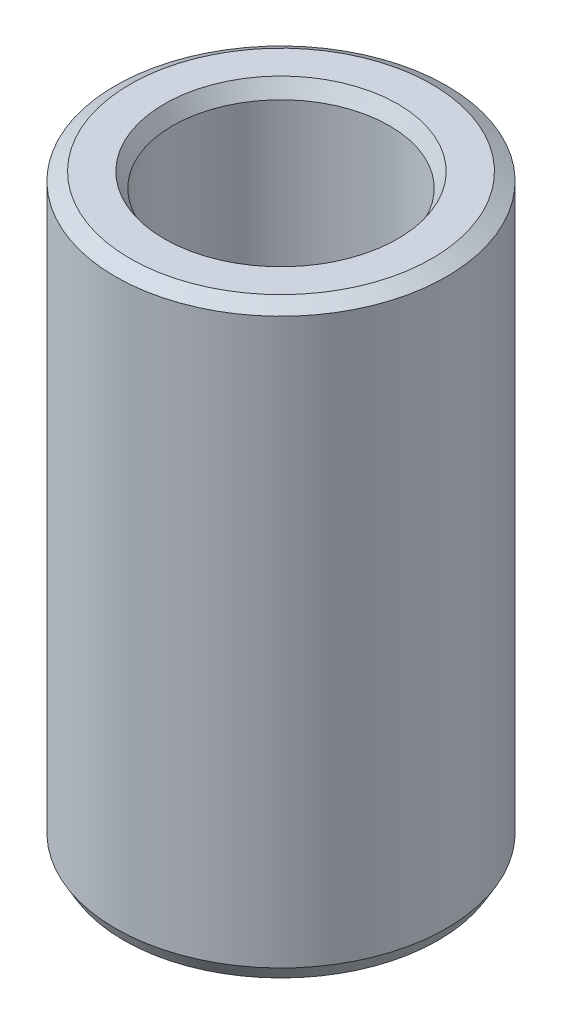
ISO-10303-21;
HEADER;
FILE_DESCRIPTION(('STEP AP214'),'2;1');
FILE_NAME('part.step','',(''),(''),'','','');
FILE_SCHEMA(('AUTOMOTIVE_DESIGN { 1 0 10303 214 1 1 1 1 }'));
ENDSEC;
DATA;
#1=APPLICATION_CONTEXT('core data for automotive mechanical design processes');
#2=APPLICATION_PROTOCOL_DEFINITION('international standard','automotive_design',2000,#1);
#3=PRODUCT_CONTEXT('',#1,'mechanical');
#4=PRODUCT('Part','Part','',(#3));
#5=PRODUCT_RELATED_PRODUCT_CATEGORY('part','',(#4));
#6=PRODUCT_DEFINITION_FORMATION('','',#4);
#7=PRODUCT_DEFINITION_CONTEXT('part definition',#1,'design');
#8=PRODUCT_DEFINITION('design','',#6,#7);
#9=PRODUCT_DEFINITION_SHAPE('','',#8);
#10=(LENGTH_UNIT() NAMED_UNIT(*) SI_UNIT(.MILLI.,.METRE.));
#11=(NAMED_UNIT(*) PLANE_ANGLE_UNIT() SI_UNIT($,.RADIAN.));
#12=(NAMED_UNIT(*) SI_UNIT($,.STERADIAN.) SOLID_ANGLE_UNIT());
#13=UNCERTAINTY_MEASURE_WITH_UNIT(LENGTH_MEASURE(1.E-05),#10,'distance_accuracy_value','');
#14=(GEOMETRIC_REPRESENTATION_CONTEXT(3) GLOBAL_UNCERTAINTY_ASSIGNED_CONTEXT((#13)) GLOBAL_UNIT_ASSIGNED_CONTEXT((#10,
#11,#12)) REPRESENTATION_CONTEXT('',''));
#15=CARTESIAN_POINT('',(0.,0.,0.));
#16=DIRECTION('',(0.,0.,1.));
#17=DIRECTION('',(1.,0.,0.));
#18=AXIS2_PLACEMENT_3D('',#15,#16,#17);
#19=CARTESIAN_POINT('',(0.,141.943823189804,0.));
#20=DIRECTION('',(0.,-1.,0.));
#21=DIRECTION('',(0.,0.,-1.));
#22=AXIS2_PLACEMENT_3D('',#19,#20,#21);
#23=CYLINDRICAL_SURFACE('',#22,40.);
#24=CARTESIAN_POINT('',(0.,3.52593530413128,0.));
#25=DIRECTION('',(0.,1.,0.));
#26=DIRECTION('',(0.,0.,1.));
#27=AXIS2_PLACEMENT_3D('',#24,#25,#26);
#28=CIRCLE('',#27,40.);
#29=CARTESIAN_POINT('',(0.,3.52593530413128,40.));
#30=VERTEX_POINT('',#29);
#31=EDGE_CURVE('E10',#30,#30,#28,.T.);
#32=ORIENTED_EDGE('',*,*,#31,.T.);
#33=EDGE_LOOP('',(#32));
#34=FACE_BOUND('',#33,.T.);
#35=CARTESIAN_POINT('',(0.,139.908123492819,0.));
#36=DIRECTION('',(0.,1.,0.));
#37=DIRECTION('',(0.,0.,1.));
#38=AXIS2_PLACEMENT_3D('',#35,#36,#37);
#39=CIRCLE('',#38,40.);
#40=CARTESIAN_POINT('',(0.,139.908123492819,40.));
#41=VERTEX_POINT('',#40);
#42=EDGE_CURVE('E50',#41,#41,#39,.F.);
#43=ORIENTED_EDGE('',*,*,#42,.T.);
#44=EDGE_LOOP('',(#43));
#45=FACE_BOUND('',#44,.T.);
#46=ADVANCED_FACE('F39',(#34,#45),#23,.T.);
#47=CARTESIAN_POINT('',(0.,141.943823189804,0.));
#48=DIRECTION('',(0.,1.,0.));
#49=DIRECTION('',(0.,0.,1.));
#50=AXIS2_PLACEMENT_3D('',#47,#48,#49);
#51=PLANE('',#50);
#52=CARTESIAN_POINT('',(0.,141.943823189804,0.));
#53=DIRECTION('',(0.,1.,0.));
#54=DIRECTION('',(0.,0.,1.));
#55=AXIS2_PLACEMENT_3D('',#52,#53,#54);
#56=CIRCLE('',#55,28.2261651632006);
#57=CARTESIAN_POINT('',(0.,141.943823189804,28.2261651632006));
#58=VERTEX_POINT('',#57);
#59=EDGE_CURVE('E58',#58,#58,#56,.F.);
#60=ORIENTED_EDGE('',*,*,#59,.T.);
#61=EDGE_LOOP('',(#60));
#62=FACE_BOUND('',#61,.T.);
#63=CARTESIAN_POINT('',(0.,141.943823189804,0.));
#64=DIRECTION('',(0.,1.,0.));
#65=DIRECTION('',(0.,0.,1.));
#66=AXIS2_PLACEMENT_3D('',#63,#64,#65);
#67=CIRCLE('',#66,36.4740646958687);
#68=CARTESIAN_POINT('',(0.,141.943823189804,36.4740646958687));
#69=VERTEX_POINT('',#68);
#70=EDGE_CURVE('E61',#69,#69,#67,.T.);
#71=ORIENTED_EDGE('',*,*,#70,.T.);
#72=EDGE_LOOP('',(#71));
#73=FACE_BOUND('',#72,.T.);
#74=ADVANCED_FACE('F88',(#62,#73),#51,.T.);
#75=CARTESIAN_POINT('',(0.,0.,0.));
#76=DIRECTION('',(0.,1.,0.));
#77=DIRECTION('',(0.,0.,1.));
#78=AXIS2_PLACEMENT_3D('',#75,#76,#77);
#79=PLANE('',#78);
#80=CARTESIAN_POINT('',(0.,0.,0.));
#81=DIRECTION('',(0.,1.,0.));
#82=DIRECTION('',(0.,0.,1.));
#83=AXIS2_PLACEMENT_3D('',#80,#81,#82);
#84=CIRCLE('',#83,29.7164007703465);
#85=CARTESIAN_POINT('',(0.,0.,29.7164007703465));
#86=VERTEX_POINT('',#85);
#87=EDGE_CURVE('E51',#86,#86,#84,.T.);
#88=ORIENTED_EDGE('',*,*,#87,.T.);
#89=EDGE_LOOP('',(#88));
#90=FACE_BOUND('',#89,.T.);
#91=CARTESIAN_POINT('',(0.,0.,0.));
#92=DIRECTION('',(0.,1.,0.));
#93=DIRECTION('',(0.,0.,1.));
#94=AXIS2_PLACEMENT_3D('',#91,#92,#93);
#95=CIRCLE('',#94,37.9643003030146);
#96=CARTESIAN_POINT('',(0.,0.,37.9643003030146));
#97=VERTEX_POINT('',#96);
#98=EDGE_CURVE('E54',#97,#97,#95,.F.);
#99=ORIENTED_EDGE('',*,*,#98,.T.);
#100=EDGE_LOOP('',(#99));
#101=FACE_BOUND('',#100,.T.);
#102=ADVANCED_FACE('F83',(#90,#101),#79,.F.);
#103=CARTESIAN_POINT('',(0.,141.943823189804,0.));
#104=DIRECTION('',(0.,-1.,0.));
#105=DIRECTION('',(0.,0.,-1.));
#106=AXIS2_PLACEMENT_3D('',#103,#104,#105);
#107=CYLINDRICAL_SURFACE('',#106,26.1904654662152);
#108=CARTESIAN_POINT('',(0.,138.417887885673,0.));
#109=DIRECTION('',(0.,1.,0.));
#110=DIRECTION('',(0.,0.,1.));
#111=AXIS2_PLACEMENT_3D('',#108,#109,#110);
#112=CIRCLE('',#111,26.1904654662152);
#113=CARTESIAN_POINT('',(0.,138.417887885673,26.1904654662152));
#114=VERTEX_POINT('',#113);
#115=EDGE_CURVE('E67',#114,#114,#112,.T.);
#116=ORIENTED_EDGE('',*,*,#115,.T.);
#117=EDGE_LOOP('',(#116));
#118=FACE_BOUND('',#117,.T.);
#119=CARTESIAN_POINT('',(0.,2.03569969698544,0.));
#120=DIRECTION('',(0.,1.,0.));
#121=DIRECTION('',(0.,0.,1.));
#122=AXIS2_PLACEMENT_3D('',#119,#120,#121);
#123=CIRCLE('',#122,26.1904654662152);
#124=CARTESIAN_POINT('',(0.,2.03569969698544,26.1904654662152));
#125=VERTEX_POINT('',#124);
#126=EDGE_CURVE('E69',#125,#125,#123,.F.);
#127=ORIENTED_EDGE('',*,*,#126,.T.);
#128=EDGE_LOOP('',(#127));
#129=FACE_BOUND('',#128,.T.);
#130=ADVANCED_FACE('F71',(#118,#129),#107,.F.);
#131=CARTESIAN_POINT('',(0.,138.417887885673,0.));
#132=DIRECTION('',(0.,1.,0.));
#133=DIRECTION('',(0.,0.,1.));
#134=AXIS2_PLACEMENT_3D('',#131,#132,#133);
#135=CONICAL_SURFACE('',#134,26.1904654662152,0.5235987755983);
#136=CARTESIAN_POINT('',(0.,141.943823189804,28.2261651632006));
#137=CARTESIAN_POINT('',(0.,141.907094697053,28.2049599580237));
#138=CARTESIAN_POINT('',(0.,141.870366204301,28.1837547528468));
#139=CARTESIAN_POINT('',(0.,141.796909218799,28.1413443424929));
#140=CARTESIAN_POINT('',(0.,141.760180726047,28.120139137316));
#141=CARTESIAN_POINT('',(0.,141.686723740544,28.0777287269621));
#142=CARTESIAN_POINT('',(0.,141.649995247793,28.0565235217852));
#143=CARTESIAN_POINT('',(0.,141.57653826229,28.0141131114313));
#144=CARTESIAN_POINT('',(0.,141.539809769539,27.9929079062544));
#145=CARTESIAN_POINT('',(0.,141.466352784036,27.9504974959005));
#146=CARTESIAN_POINT('',(0.,141.429624291285,27.9292922907236));
#147=CARTESIAN_POINT('',(0.,141.356167305782,27.8868818803697));
#148=CARTESIAN_POINT('',(0.,141.319438813031,27.8656766751928));
#149=CARTESIAN_POINT('',(0.,141.245981827528,27.8232662648389));
#150=CARTESIAN_POINT('',(0.,141.209253334777,27.802061059662));
#151=CARTESIAN_POINT('',(0.,141.135796349274,27.7596506493081));
#152=CARTESIAN_POINT('',(0.,141.099067856523,27.7384454441312));
#153=CARTESIAN_POINT('',(0.,141.02561087102,27.6960350337773));
#154=CARTESIAN_POINT('',(0.,140.988882378268,27.6748298286004));
#155=CARTESIAN_POINT('',(0.,140.915425392766,27.6324194182465));
#156=CARTESIAN_POINT('',(0.,140.878696900014,27.6112142130696));
#157=CARTESIAN_POINT('',(0.,140.805239914512,27.5688038027157));
#158=CARTESIAN_POINT('',(0.,140.76851142176,27.5475985975388));
#159=CARTESIAN_POINT('',(0.,140.695054436258,27.5051881871849));
#160=CARTESIAN_POINT('',(0.,140.658325943506,27.483982982008));
#161=CARTESIAN_POINT('',(0.,140.584868958003,27.4415725716542));
#162=CARTESIAN_POINT('',(0.,140.548140465252,27.4203673664772));
#163=CARTESIAN_POINT('',(0.,140.474683479749,27.3779569561234));
#164=CARTESIAN_POINT('',(0.,140.437954986998,27.3567517509464));
#165=CARTESIAN_POINT('',(0.,140.364498001495,27.3143413405926));
#166=CARTESIAN_POINT('',(0.,140.327769508744,27.2931361354156));
#167=CARTESIAN_POINT('',(0.,140.254312523241,27.2507257250618));
#168=CARTESIAN_POINT('',(0.,140.21758403049,27.2295205198848));
#169=CARTESIAN_POINT('',(0.,140.144127044987,27.187110109531));
#170=CARTESIAN_POINT('',(0.,140.107398552236,27.165904904354));
#171=CARTESIAN_POINT('',(0.,140.033941566733,27.1234944940002));
#172=CARTESIAN_POINT('',(0.,139.997213073982,27.1022892888232));
#173=CARTESIAN_POINT('',(0.,139.923756088479,27.0598788784694));
#174=CARTESIAN_POINT('',(0.,139.887027595727,27.0386736732925));
#175=CARTESIAN_POINT('',(0.,139.813570610225,26.9962632629386));
#176=CARTESIAN_POINT('',(0.,139.776842117473,26.9750580577617));
#177=CARTESIAN_POINT('',(0.,139.703385131971,26.9326476474078));
#178=CARTESIAN_POINT('',(0.,139.666656639219,26.9114424422309));
#179=CARTESIAN_POINT('',(0.,139.593199653716,26.869032031877));
#180=CARTESIAN_POINT('',(0.,139.556471160965,26.8478268267001));
#181=CARTESIAN_POINT('',(0.,139.483014175462,26.8054164163462));
#182=CARTESIAN_POINT('',(0.,139.446285682711,26.7842112111693));
#183=CARTESIAN_POINT('',(0.,139.372828697208,26.7418008008154));
#184=CARTESIAN_POINT('',(0.,139.336100204457,26.7205955956385));
#185=CARTESIAN_POINT('',(0.,139.262643218954,26.6781851852846));
#186=CARTESIAN_POINT('',(0.,139.225914726203,26.6569799801077));
#187=CARTESIAN_POINT('',(0.,139.1524577407,26.6145695697538));
#188=CARTESIAN_POINT('',(0.,139.115729247949,26.5933643645769));
#189=CARTESIAN_POINT('',(0.,139.042272262446,26.550953954223));
#190=CARTESIAN_POINT('',(0.,139.005543769695,26.5297487490461));
#191=CARTESIAN_POINT('',(0.,138.932086784192,26.4873383386922));
#192=CARTESIAN_POINT('',(0.,138.89535829144,26.4661331335153));
#193=CARTESIAN_POINT('',(0.,138.821901305938,26.4237227231614));
#194=CARTESIAN_POINT('',(0.,138.785172813186,26.4025175179845));
#195=CARTESIAN_POINT('',(0.,138.711715827684,26.3601071076306));
#196=CARTESIAN_POINT('',(0.,138.674987334932,26.3389019024537));
#197=CARTESIAN_POINT('',(0.,138.60153034943,26.2964914920998));
#198=CARTESIAN_POINT('',(0.,138.564801856678,26.2752862869229));
#199=CARTESIAN_POINT('',(0.,138.491344871175,26.2328758765691));
#200=CARTESIAN_POINT('',(0.,138.454616378424,26.2116706713921));
#201=CARTESIAN_POINT('',(0.,138.417887885673,26.1904654662152));
#202=B_SPLINE_CURVE_WITH_KNOTS('',3,(#136,#137,#138,#139,#140,#141,#142,#143,#144,#145,#146,
#147,#148,#149,#150,#151,#152,#153,#154,#155,#156,#157,#158,#159,#160,#161,#162,#163,#164,#165,
#166,#167,#168,#169,#170,#171,#172,#173,#174,#175,#176,#177,#178,#179,#180,#181,#182,#183,#184,
#185,#186,#187,#188,#189,#190,#191,#192,#193,#194,#195,#196,#197,#198,#199,#200,#201),
.UNSPECIFIED.,.F.,.F.,(4,2,2,2,2,2,2,2,2,2,2,2,2,2,2,2,2,2,2,2,2,2,2,2,2,2,2,2,2,2,2,2,4),(0.,
0.1272312310616,0.2544624621232,0.381693693184774,0.508924924246374,0.63615615530795,
0.763387386369548,0.890618617431148,1.01784984849272,1.14508107955432,1.2723123106159,
1.3995435416775,1.5267747727391,1.65400600380067,1.78123723486227,1.90846846592385,
2.03569969698545,2.16293092804705,2.29016215910862,2.41739339017022,2.5446246212318,
2.6718558522934,2.79908708335499,2.92631831441657,3.05354954547817,3.18078077653974,
3.30801200760134,3.43524323866294,3.56247446972452,3.68970570078612,3.81693693184769,
3.94416816290929,4.07139939397087),.UNSPECIFIED.);
#203=EDGE_CURVE('BSEAM77',#58,#114,#202,.T.);
#204=ORIENTED_EDGE('',*,*,#59,.F.);
#205=ORIENTED_EDGE('',*,*,#115,.F.);
#206=ORIENTED_EDGE('',*,*,#203,.T.);
#207=ORIENTED_EDGE('',*,*,#203,.F.);
#208=EDGE_LOOP('',(#204,#206,#205,#207));
#209=FACE_BOUND('',#208,.T.);
#210=ADVANCED_FACE('F77',(#209),#135,.F.);
#211=CARTESIAN_POINT('',(0.,0.,0.));
#212=DIRECTION('',(0.,-1.,0.));
#213=DIRECTION('',(0.,0.,-1.));
#214=AXIS2_PLACEMENT_3D('',#211,#212,#213);
#215=CONICAL_SURFACE('',#214,29.7164007703465,1.04719755119659);
#216=ORIENTED_EDGE('',*,*,#126,.F.);
#217=EDGE_LOOP('',(#216));
#218=FACE_BOUND('',#217,.T.);
#219=ORIENTED_EDGE('',*,*,#87,.F.);
#220=EDGE_LOOP('',(#219));
#221=FACE_BOUND('',#220,.T.);
#222=ADVANCED_FACE('F73',(#218,#221),#215,.F.);
#223=CARTESIAN_POINT('',(0.,3.52593530413128,0.));
#224=DIRECTION('',(0.,1.,0.));
#225=DIRECTION('',(0.,0.,1.));
#226=AXIS2_PLACEMENT_3D('',#223,#224,#225);
#227=CONICAL_SURFACE('',#226,40.,0.5235987755983);
#228=ORIENTED_EDGE('',*,*,#98,.F.);
#229=EDGE_LOOP('',(#228));
#230=FACE_BOUND('',#229,.T.);
#231=ORIENTED_EDGE('',*,*,#31,.F.);
#232=EDGE_LOOP('',(#231));
#233=FACE_BOUND('',#232,.T.);
#234=ADVANCED_FACE('F76',(#230,#233),#227,.T.);
#235=CARTESIAN_POINT('',(0.,141.943823189804,0.));
#236=DIRECTION('',(0.,-1.,0.));
#237=DIRECTION('',(0.,0.,-1.));
#238=AXIS2_PLACEMENT_3D('',#235,#236,#237);
#239=CONICAL_SURFACE('',#238,36.4740646958687,1.04719755119659);
#240=ORIENTED_EDGE('',*,*,#42,.F.);
#241=EDGE_LOOP('',(#240));
#242=FACE_BOUND('',#241,.T.);
#243=ORIENTED_EDGE('',*,*,#70,.F.);
#244=EDGE_LOOP('',(#243));
#245=FACE_BOUND('',#244,.T.);
#246=ADVANCED_FACE('F45',(#242,#245),#239,.T.);
#247=CLOSED_SHELL('',(#46,#74,#102,#130,#210,#222,#234,#246));
#248=MANIFOLD_SOLID_BREP('B2',#247);
#249=ADVANCED_BREP_SHAPE_REPRESENTATION('',(#18,#248),#14);
#250=SHAPE_DEFINITION_REPRESENTATION(#9,#249);
ENDSEC;
END-ISO-10303-21;
